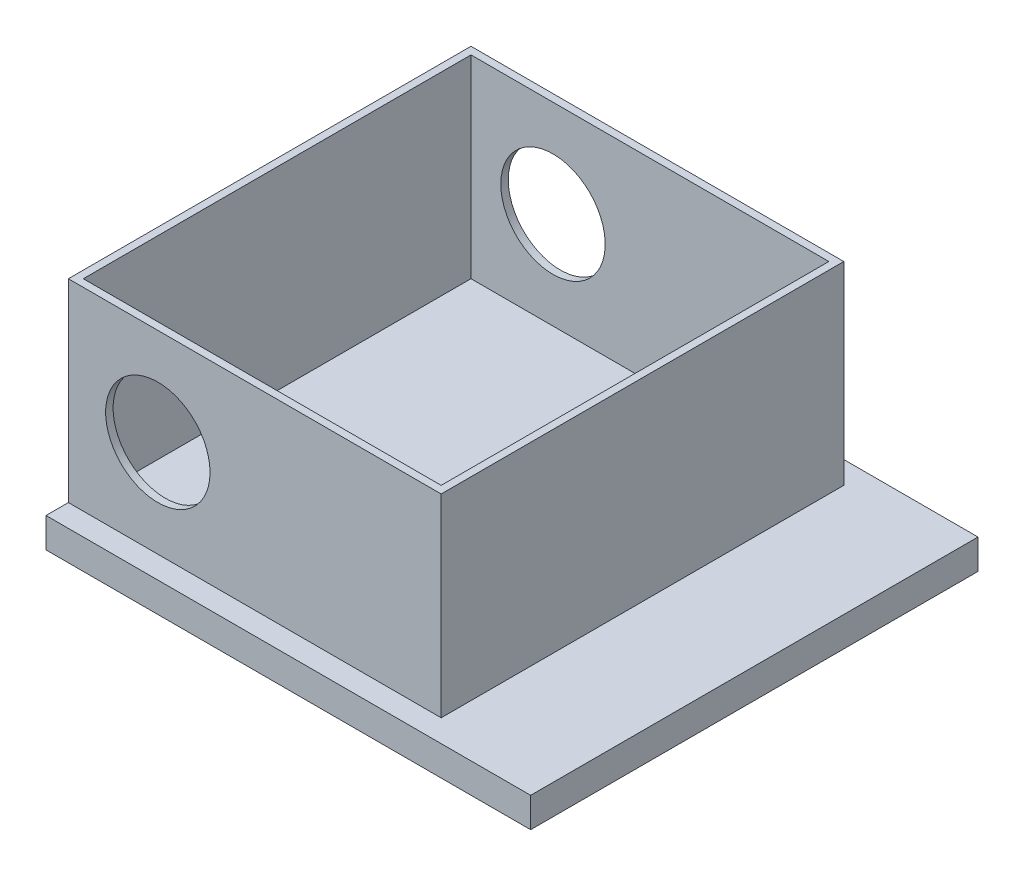
ISO-10303-21;
HEADER;
FILE_DESCRIPTION(('STEP AP214'),'2;1');
FILE_NAME('part.step','',(''),(''),'','','');
FILE_SCHEMA(('AUTOMOTIVE_DESIGN { 1 0 10303 214 1 1 1 1 }'));
ENDSEC;
DATA;
#1=APPLICATION_CONTEXT('core data for automotive mechanical design processes');
#2=APPLICATION_PROTOCOL_DEFINITION('international standard','automotive_design',2000,#1);
#3=PRODUCT_CONTEXT('',#1,'mechanical');
#4=PRODUCT('Part','Part','',(#3));
#5=PRODUCT_RELATED_PRODUCT_CATEGORY('part','',(#4));
#6=PRODUCT_DEFINITION_FORMATION('','',#4);
#7=PRODUCT_DEFINITION_CONTEXT('part definition',#1,'design');
#8=PRODUCT_DEFINITION('design','',#6,#7);
#9=PRODUCT_DEFINITION_SHAPE('','',#8);
#10=(LENGTH_UNIT() NAMED_UNIT(*) SI_UNIT(.MILLI.,.METRE.));
#11=(NAMED_UNIT(*) PLANE_ANGLE_UNIT() SI_UNIT($,.RADIAN.));
#12=(NAMED_UNIT(*) SI_UNIT($,.STERADIAN.) SOLID_ANGLE_UNIT());
#13=UNCERTAINTY_MEASURE_WITH_UNIT(LENGTH_MEASURE(1.E-05),#10,'distance_accuracy_value','');
#14=(GEOMETRIC_REPRESENTATION_CONTEXT(3) GLOBAL_UNCERTAINTY_ASSIGNED_CONTEXT((#13)) GLOBAL_UNIT_ASSIGNED_CONTEXT((#10,
#11,#12)) REPRESENTATION_CONTEXT('',''));
#15=CARTESIAN_POINT('',(0.,0.,0.));
#16=DIRECTION('',(0.,0.,1.));
#17=DIRECTION('',(1.,0.,0.));
#18=AXIS2_PLACEMENT_3D('',#15,#16,#17);
#19=CARTESIAN_POINT('',(0.,2.,0.));
#20=DIRECTION('',(0.,1.,0.));
#21=DIRECTION('',(0.,0.,1.));
#22=AXIS2_PLACEMENT_3D('',#19,#20,#21);
#23=PLANE('',#22);
#24=DIRECTION('',(0.,0.,1.));
#25=VECTOR('',#24,1.);
#26=CARTESIAN_POINT('',(4.57894736842105,2.,0.));
#27=LINE('',#26,#25);
#28=CARTESIAN_POINT('',(4.57894736842105,2.,-23.7894736842105));
#29=VERTEX_POINT('',#28);
#30=CARTESIAN_POINT('',(4.57894736842105,2.,3.21052631578947));
#31=VERTEX_POINT('',#30);
#32=EDGE_CURVE('E213',#29,#31,#27,.T.);
#33=ORIENTED_EDGE('',*,*,#32,.T.);
#34=DIRECTION('',(-1.,0.,0.));
#35=VECTOR('',#34,1.);
#36=CARTESIAN_POINT('',(0.,2.,3.21052631578947));
#37=LINE('',#36,#35);
#38=CARTESIAN_POINT('',(-20.421052631579,2.,3.21052631578947));
#39=VERTEX_POINT('',#38);
#40=EDGE_CURVE('E217',#31,#39,#37,.T.);
#41=ORIENTED_EDGE('',*,*,#40,.T.);
#42=DIRECTION('',(0.,0.,-1.));
#43=VECTOR('',#42,1.);
#44=CARTESIAN_POINT('',(-20.421052631579,2.,0.));
#45=LINE('',#44,#43);
#46=CARTESIAN_POINT('',(-20.421052631579,2.,4.71052631578947));
#47=VERTEX_POINT('',#46);
#48=EDGE_CURVE('E139',#47,#39,#45,.T.);
#49=ORIENTED_EDGE('',*,*,#48,.F.);
#50=DIRECTION('',(-1.,0.,0.));
#51=VECTOR('',#50,1.);
#52=CARTESIAN_POINT('',(0.,2.,4.71052631578947));
#53=LINE('',#52,#51);
#54=CARTESIAN_POINT('',(12.078947368421,2.,4.71052631578946));
#55=VERTEX_POINT('',#54);
#56=EDGE_CURVE('E235',#55,#47,#53,.T.);
#57=ORIENTED_EDGE('',*,*,#56,.F.);
#58=DIRECTION('',(0.,0.,1.));
#59=VECTOR('',#58,1.);
#60=CARTESIAN_POINT('',(12.078947368421,2.,0.));
#61=LINE('',#60,#59);
#62=CARTESIAN_POINT('',(12.078947368421,2.,-25.2894736842105));
#63=VERTEX_POINT('',#62);
#64=EDGE_CURVE('E240',#63,#55,#61,.T.);
#65=ORIENTED_EDGE('',*,*,#64,.F.);
#66=DIRECTION('',(1.,0.,0.));
#67=VECTOR('',#66,1.);
#68=CARTESIAN_POINT('',(0.,2.,-25.2894736842105));
#69=LINE('',#68,#67);
#70=CARTESIAN_POINT('',(-20.421052631579,2.,-25.2894736842105));
#71=VERTEX_POINT('',#70);
#72=EDGE_CURVE('E244',#71,#63,#69,.T.);
#73=ORIENTED_EDGE('',*,*,#72,.F.);
#74=CARTESIAN_POINT('',(-20.421052631579,2.,-23.7894736842105));
#75=VERTEX_POINT('',#74);
#76=EDGE_CURVE('E236',#75,#71,#45,.T.);
#77=ORIENTED_EDGE('',*,*,#76,.F.);
#78=DIRECTION('',(1.,0.,0.));
#79=VECTOR('',#78,1.);
#80=CARTESIAN_POINT('',(0.,2.,-23.7894736842105));
#81=LINE('',#80,#79);
#82=EDGE_CURVE('E209',#75,#29,#81,.T.);
#83=ORIENTED_EDGE('',*,*,#82,.T.);
#84=EDGE_LOOP('',(#33,#41,#49,#57,#65,#73,#77,#83));
#85=FACE_BOUND('',#84,.T.);
#86=ADVANCED_FACE('F41',(#85),#23,.T.);
#87=CARTESIAN_POINT('',(-20.421052631579,2.,0.));
#88=DIRECTION('',(-1.,0.,0.));
#89=DIRECTION('',(0.,0.,1.));
#90=AXIS2_PLACEMENT_3D('',#87,#88,#89);
#91=PLANE('',#90);
#92=DIRECTION('',(0.,-1.,0.));
#93=VECTOR('',#92,1.);
#94=CARTESIAN_POINT('',(-20.421052631579,2.,-25.2894736842105));
#95=LINE('',#94,#93);
#96=CARTESIAN_POINT('',(-20.421052631579,0.,-25.2894736842105));
#97=VERTEX_POINT('',#96);
#98=EDGE_CURVE('E248',#71,#97,#95,.T.);
#99=ORIENTED_EDGE('',*,*,#98,.T.);
#100=DIRECTION('',(0.,0.,-1.));
#101=VECTOR('',#100,1.);
#102=CARTESIAN_POINT('',(-20.421052631579,0.,0.));
#103=LINE('',#102,#101);
#104=CARTESIAN_POINT('',(-20.421052631579,0.,4.71052631578947));
#105=VERTEX_POINT('',#104);
#106=EDGE_CURVE('E232',#105,#97,#103,.T.);
#107=ORIENTED_EDGE('',*,*,#106,.F.);
#108=DIRECTION('',(0.,-1.,0.));
#109=VECTOR('',#108,1.);
#110=CARTESIAN_POINT('',(-20.421052631579,2.,4.71052631578947));
#111=LINE('',#110,#109);
#112=EDGE_CURVE('E11',#47,#105,#111,.T.);
#113=ORIENTED_EDGE('',*,*,#112,.F.);
#114=ORIENTED_EDGE('',*,*,#48,.T.);
#115=DIRECTION('',(0.,-1.,0.));
#116=VECTOR('',#115,1.);
#117=CARTESIAN_POINT('',(-20.421052631579,15.,3.21052631578947));
#118=LINE('',#117,#116);
#119=CARTESIAN_POINT('',(-20.421052631579,15.,3.21052631578947));
#120=VERTEX_POINT('',#119);
#121=EDGE_CURVE('E132',#120,#39,#118,.T.);
#122=ORIENTED_EDGE('',*,*,#121,.F.);
#123=DIRECTION('',(0.,0.,-1.));
#124=VECTOR('',#123,1.);
#125=CARTESIAN_POINT('',(-20.421052631579,15.,0.));
#126=LINE('',#125,#124);
#127=CARTESIAN_POINT('',(-20.421052631579,15.,-23.7894736842105));
#128=VERTEX_POINT('',#127);
#129=EDGE_CURVE('E137',#120,#128,#126,.T.);
#130=ORIENTED_EDGE('',*,*,#129,.T.);
#131=DIRECTION('',(0.,-1.,0.));
#132=VECTOR('',#131,1.);
#133=CARTESIAN_POINT('',(-20.421052631579,15.,-23.7894736842105));
#134=LINE('',#133,#132);
#135=EDGE_CURVE('E185',#128,#75,#134,.T.);
#136=ORIENTED_EDGE('',*,*,#135,.T.);
#137=ORIENTED_EDGE('',*,*,#76,.T.);
#138=EDGE_LOOP('',(#99,#107,#113,#114,#122,#130,#136,#137));
#139=FACE_BOUND('',#138,.T.);
#140=ADVANCED_FACE('F43',(#139),#91,.T.);
#141=CARTESIAN_POINT('',(0.,2.,4.71052631578947));
#142=DIRECTION('',(0.,0.,1.));
#143=DIRECTION('',(1.,0.,0.));
#144=AXIS2_PLACEMENT_3D('',#141,#142,#143);
#145=PLANE('',#144);
#146=DIRECTION('',(-1.,0.,0.));
#147=VECTOR('',#146,1.);
#148=CARTESIAN_POINT('',(0.,0.,4.71052631578947));
#149=LINE('',#148,#147);
#150=CARTESIAN_POINT('',(12.078947368421,0.,4.71052631578946));
#151=VERTEX_POINT('',#150);
#152=EDGE_CURVE('E251',#151,#105,#149,.T.);
#153=ORIENTED_EDGE('',*,*,#152,.F.);
#154=DIRECTION('',(0.,-1.,0.));
#155=VECTOR('',#154,1.);
#156=CARTESIAN_POINT('',(12.078947368421,2.,4.71052631578946));
#157=LINE('',#156,#155);
#158=EDGE_CURVE('E50',#55,#151,#157,.T.);
#159=ORIENTED_EDGE('',*,*,#158,.F.);
#160=ORIENTED_EDGE('',*,*,#56,.T.);
#161=ORIENTED_EDGE('',*,*,#112,.T.);
#162=EDGE_LOOP('',(#153,#159,#160,#161));
#163=FACE_BOUND('',#162,.T.);
#164=ADVANCED_FACE('F275',(#163),#145,.T.);
#165=CARTESIAN_POINT('',(12.078947368421,2.,0.));
#166=DIRECTION('',(1.,0.,0.));
#167=DIRECTION('',(0.,0.,-1.));
#168=AXIS2_PLACEMENT_3D('',#165,#166,#167);
#169=PLANE('',#168);
#170=DIRECTION('',(0.,0.,1.));
#171=VECTOR('',#170,1.);
#172=CARTESIAN_POINT('',(12.078947368421,0.,0.));
#173=LINE('',#172,#171);
#174=CARTESIAN_POINT('',(12.078947368421,0.,-25.2894736842105));
#175=VERTEX_POINT('',#174);
#176=EDGE_CURVE('E255',#175,#151,#173,.T.);
#177=ORIENTED_EDGE('',*,*,#176,.F.);
#178=DIRECTION('',(0.,-1.,0.));
#179=VECTOR('',#178,1.);
#180=CARTESIAN_POINT('',(12.078947368421,2.,-25.2894736842105));
#181=LINE('',#180,#179);
#182=EDGE_CURVE('E265',#63,#175,#181,.T.);
#183=ORIENTED_EDGE('',*,*,#182,.F.);
#184=ORIENTED_EDGE('',*,*,#64,.T.);
#185=ORIENTED_EDGE('',*,*,#158,.T.);
#186=EDGE_LOOP('',(#177,#183,#184,#185));
#187=FACE_BOUND('',#186,.T.);
#188=ADVANCED_FACE('F271',(#187),#169,.T.);
#189=CARTESIAN_POINT('',(0.,2.,-25.2894736842105));
#190=DIRECTION('',(0.,0.,-1.));
#191=DIRECTION('',(-1.,0.,0.));
#192=AXIS2_PLACEMENT_3D('',#189,#190,#191);
#193=PLANE('',#192);
#194=DIRECTION('',(1.,0.,0.));
#195=VECTOR('',#194,1.);
#196=CARTESIAN_POINT('',(0.,0.,-25.2894736842105));
#197=LINE('',#196,#195);
#198=EDGE_CURVE('E259',#97,#175,#197,.T.);
#199=ORIENTED_EDGE('',*,*,#198,.F.);
#200=ORIENTED_EDGE('',*,*,#98,.F.);
#201=ORIENTED_EDGE('',*,*,#72,.T.);
#202=ORIENTED_EDGE('',*,*,#182,.T.);
#203=EDGE_LOOP('',(#199,#200,#201,#202));
#204=FACE_BOUND('',#203,.T.);
#205=ADVANCED_FACE('F282',(#204),#193,.T.);
#206=CARTESIAN_POINT('',(0.,0.,0.));
#207=DIRECTION('',(0.,1.,0.));
#208=DIRECTION('',(0.,0.,1.));
#209=AXIS2_PLACEMENT_3D('',#206,#207,#208);
#210=PLANE('',#209);
#211=ORIENTED_EDGE('',*,*,#106,.T.);
#212=ORIENTED_EDGE('',*,*,#198,.T.);
#213=ORIENTED_EDGE('',*,*,#176,.T.);
#214=ORIENTED_EDGE('',*,*,#152,.T.);
#215=EDGE_LOOP('',(#211,#212,#213,#214));
#216=FACE_BOUND('',#215,.T.);
#217=ADVANCED_FACE('F278',(#216),#210,.F.);
#218=CARTESIAN_POINT('',(0.,15.,2.71052631578947));
#219=DIRECTION('',(0.,0.,1.));
#220=DIRECTION('',(1.,0.,0.));
#221=AXIS2_PLACEMENT_3D('',#218,#219,#220);
#222=PLANE('',#221);
#223=CARTESIAN_POINT('',(-14.421052631579,8.5,2.71052631578947));
#224=DIRECTION('',(0.,0.,1.));
#225=DIRECTION('',(1.,0.,0.));
#226=AXIS2_PLACEMENT_3D('',#223,#224,#225);
#227=CIRCLE('',#226,3.5);
#228=CARTESIAN_POINT('',(-10.921052631579,8.5,2.71052631578947));
#229=VERTEX_POINT('',#228);
#230=EDGE_CURVE('E160',#229,#229,#227,.T.);
#231=ORIENTED_EDGE('',*,*,#230,.T.);
#232=EDGE_LOOP('',(#231));
#233=FACE_BOUND('',#232,.T.);
#234=DIRECTION('',(1.,0.,0.));
#235=VECTOR('',#234,1.);
#236=CARTESIAN_POINT('',(0.,2.,2.71052631578947));
#237=LINE('',#236,#235);
#238=CARTESIAN_POINT('',(-19.921052631579,2.,2.71052631578947));
#239=VERTEX_POINT('',#238);
#240=CARTESIAN_POINT('',(4.07894736842105,2.,2.71052631578946));
#241=VERTEX_POINT('',#240);
#242=EDGE_CURVE('E228',#239,#241,#237,.T.);
#243=ORIENTED_EDGE('',*,*,#242,.F.);
#244=DIRECTION('',(0.,-1.,0.));
#245=VECTOR('',#244,1.);
#246=CARTESIAN_POINT('',(-19.921052631579,15.,2.71052631578947));
#247=LINE('',#246,#245);
#248=CARTESIAN_POINT('',(-19.921052631579,15.,2.71052631578947));
#249=VERTEX_POINT('',#248);
#250=EDGE_CURVE('E195',#249,#239,#247,.T.);
#251=ORIENTED_EDGE('',*,*,#250,.F.);
#252=DIRECTION('',(-1.,0.,0.));
#253=VECTOR('',#252,1.);
#254=CARTESIAN_POINT('',(0.,15.,2.71052631578947));
#255=LINE('',#254,#253);
#256=CARTESIAN_POINT('',(4.07894736842105,15.,2.71052631578946));
#257=VERTEX_POINT('',#256);
#258=EDGE_CURVE('E172',#257,#249,#255,.T.);
#259=ORIENTED_EDGE('',*,*,#258,.F.);
#260=DIRECTION('',(0.,-1.,0.));
#261=VECTOR('',#260,1.);
#262=CARTESIAN_POINT('',(4.07894736842105,15.,2.71052631578946));
#263=LINE('',#262,#261);
#264=EDGE_CURVE('E143',#257,#241,#263,.T.);
#265=ORIENTED_EDGE('',*,*,#264,.T.);
#266=EDGE_LOOP('',(#243,#251,#259,#265));
#267=FACE_BOUND('',#266,.T.);
#268=ADVANCED_FACE('F331',(#233,#267),#222,.F.);
#269=CARTESIAN_POINT('',(-19.921052631579,15.,0.));
#270=DIRECTION('',(-1.,0.,0.));
#271=DIRECTION('',(0.,0.,1.));
#272=AXIS2_PLACEMENT_3D('',#269,#270,#271);
#273=PLANE('',#272);
#274=DIRECTION('',(0.,0.,1.));
#275=VECTOR('',#274,1.);
#276=CARTESIAN_POINT('',(-19.921052631579,2.,0.));
#277=LINE('',#276,#275);
#278=CARTESIAN_POINT('',(-19.921052631579,2.,-23.2894736842105));
#279=VERTEX_POINT('',#278);
#280=EDGE_CURVE('E224',#279,#239,#277,.T.);
#281=ORIENTED_EDGE('',*,*,#280,.F.);
#282=DIRECTION('',(0.,-1.,0.));
#283=VECTOR('',#282,1.);
#284=CARTESIAN_POINT('',(-19.921052631579,15.,-23.2894736842105));
#285=LINE('',#284,#283);
#286=CARTESIAN_POINT('',(-19.921052631579,15.,-23.2894736842105));
#287=VERTEX_POINT('',#286);
#288=EDGE_CURVE('E191',#287,#279,#285,.T.);
#289=ORIENTED_EDGE('',*,*,#288,.F.);
#290=DIRECTION('',(0.,0.,-1.));
#291=VECTOR('',#290,1.);
#292=CARTESIAN_POINT('',(-19.921052631579,15.,0.));
#293=LINE('',#292,#291);
#294=EDGE_CURVE('E176',#249,#287,#293,.T.);
#295=ORIENTED_EDGE('',*,*,#294,.F.);
#296=ORIENTED_EDGE('',*,*,#250,.T.);
#297=EDGE_LOOP('',(#281,#289,#295,#296));
#298=FACE_BOUND('',#297,.T.);
#299=ADVANCED_FACE('F323',(#298),#273,.F.);
#300=CARTESIAN_POINT('',(0.,15.,-23.2894736842105));
#301=DIRECTION('',(0.,0.,-1.));
#302=DIRECTION('',(-1.,0.,0.));
#303=AXIS2_PLACEMENT_3D('',#300,#301,#302);
#304=PLANE('',#303);
#305=CARTESIAN_POINT('',(-14.421052631579,8.5,-23.2894736842105));
#306=DIRECTION('',(0.,0.,-1.));
#307=DIRECTION('',(-1.,0.,0.));
#308=AXIS2_PLACEMENT_3D('',#305,#306,#307);
#309=CIRCLE('',#308,3.5);
#310=CARTESIAN_POINT('',(-17.921052631579,8.5,-23.2894736842105));
#311=VERTEX_POINT('',#310);
#312=EDGE_CURVE('E350',#311,#311,#309,.T.);
#313=ORIENTED_EDGE('',*,*,#312,.T.);
#314=EDGE_LOOP('',(#313));
#315=FACE_BOUND('',#314,.T.);
#316=DIRECTION('',(-1.,0.,0.));
#317=VECTOR('',#316,1.);
#318=CARTESIAN_POINT('',(0.,2.,-23.2894736842105));
#319=LINE('',#318,#317);
#320=CARTESIAN_POINT('',(4.07894736842105,2.,-23.2894736842105));
#321=VERTEX_POINT('',#320);
#322=EDGE_CURVE('E220',#321,#279,#319,.T.);
#323=ORIENTED_EDGE('',*,*,#322,.F.);
#324=DIRECTION('',(0.,-1.,0.));
#325=VECTOR('',#324,1.);
#326=CARTESIAN_POINT('',(4.07894736842105,15.,-23.2894736842105));
#327=LINE('',#326,#325);
#328=CARTESIAN_POINT('',(4.07894736842105,15.,-23.2894736842105));
#329=VERTEX_POINT('',#328);
#330=EDGE_CURVE('E65',#329,#321,#327,.T.);
#331=ORIENTED_EDGE('',*,*,#330,.F.);
#332=DIRECTION('',(1.,0.,0.));
#333=VECTOR('',#332,1.);
#334=CARTESIAN_POINT('',(0.,15.,-23.2894736842105));
#335=LINE('',#334,#333);
#336=EDGE_CURVE('E179',#287,#329,#335,.T.);
#337=ORIENTED_EDGE('',*,*,#336,.F.);
#338=ORIENTED_EDGE('',*,*,#288,.T.);
#339=EDGE_LOOP('',(#323,#331,#337,#338));
#340=FACE_BOUND('',#339,.T.);
#341=ADVANCED_FACE('F327',(#315,#340),#304,.F.);
#342=CARTESIAN_POINT('',(0.,15.,3.21052631578947));
#343=DIRECTION('',(0.,0.,-1.));
#344=DIRECTION('',(-1.,0.,0.));
#345=AXIS2_PLACEMENT_3D('',#342,#343,#344);
#346=PLANE('',#345);
#347=CARTESIAN_POINT('',(-14.421052631579,8.5,3.21052631578947));
#348=DIRECTION('',(0.,0.,1.));
#349=DIRECTION('',(1.,0.,0.));
#350=AXIS2_PLACEMENT_3D('',#347,#348,#349);
#351=CIRCLE('',#350,3.5);
#352=CARTESIAN_POINT('',(-10.921052631579,8.5,3.21052631578947));
#353=VERTEX_POINT('',#352);
#354=EDGE_CURVE('E164',#353,#353,#351,.T.);
#355=ORIENTED_EDGE('',*,*,#354,.F.);
#356=EDGE_LOOP('',(#355));
#357=FACE_BOUND('',#356,.T.);
#358=ORIENTED_EDGE('',*,*,#40,.F.);
#359=DIRECTION('',(0.,-1.,0.));
#360=VECTOR('',#359,1.);
#361=CARTESIAN_POINT('',(4.57894736842105,15.,3.21052631578947));
#362=LINE('',#361,#360);
#363=CARTESIAN_POINT('',(4.57894736842105,15.,3.21052631578947));
#364=VERTEX_POINT('',#363);
#365=EDGE_CURVE('E144',#364,#31,#362,.T.);
#366=ORIENTED_EDGE('',*,*,#365,.F.);
#367=DIRECTION('',(1.,0.,0.));
#368=VECTOR('',#367,1.);
#369=CARTESIAN_POINT('',(0.,15.,3.21052631578947));
#370=LINE('',#369,#368);
#371=EDGE_CURVE('E147',#120,#364,#370,.T.);
#372=ORIENTED_EDGE('',*,*,#371,.F.);
#373=ORIENTED_EDGE('',*,*,#121,.T.);
#374=EDGE_LOOP('',(#358,#366,#372,#373));
#375=FACE_BOUND('',#374,.T.);
#376=ADVANCED_FACE('F148',(#357,#375),#346,.F.);
#377=CARTESIAN_POINT('',(4.57894736842105,15.,0.));
#378=DIRECTION('',(-1.,0.,0.));
#379=DIRECTION('',(0.,0.,1.));
#380=AXIS2_PLACEMENT_3D('',#377,#378,#379);
#381=PLANE('',#380);
#382=ORIENTED_EDGE('',*,*,#32,.F.);
#383=DIRECTION('',(0.,-1.,0.));
#384=VECTOR('',#383,1.);
#385=CARTESIAN_POINT('',(4.57894736842105,15.,-23.7894736842105));
#386=LINE('',#385,#384);
#387=CARTESIAN_POINT('',(4.57894736842105,15.,-23.7894736842105));
#388=VERTEX_POINT('',#387);
#389=EDGE_CURVE('E57',#388,#29,#386,.T.);
#390=ORIENTED_EDGE('',*,*,#389,.F.);
#391=DIRECTION('',(0.,0.,-1.));
#392=VECTOR('',#391,1.);
#393=CARTESIAN_POINT('',(4.57894736842105,15.,0.));
#394=LINE('',#393,#392);
#395=EDGE_CURVE('E153',#364,#388,#394,.T.);
#396=ORIENTED_EDGE('',*,*,#395,.F.);
#397=ORIENTED_EDGE('',*,*,#365,.T.);
#398=EDGE_LOOP('',(#382,#390,#396,#397));
#399=FACE_BOUND('',#398,.T.);
#400=ADVANCED_FACE('F287',(#399),#381,.F.);
#401=CARTESIAN_POINT('',(0.,15.,-23.7894736842105));
#402=DIRECTION('',(0.,0.,1.));
#403=DIRECTION('',(1.,0.,0.));
#404=AXIS2_PLACEMENT_3D('',#401,#402,#403);
#405=PLANE('',#404);
#406=CARTESIAN_POINT('',(-14.421052631579,8.5,-23.7894736842105));
#407=DIRECTION('',(0.,0.,-1.));
#408=DIRECTION('',(-1.,0.,0.));
#409=AXIS2_PLACEMENT_3D('',#406,#407,#408);
#410=CIRCLE('',#409,3.5);
#411=CARTESIAN_POINT('',(-17.921052631579,8.5,-23.7894736842105));
#412=VERTEX_POINT('',#411);
#413=EDGE_CURVE('E352',#412,#412,#410,.T.);
#414=ORIENTED_EDGE('',*,*,#413,.F.);
#415=EDGE_LOOP('',(#414));
#416=FACE_BOUND('',#415,.T.);
#417=ORIENTED_EDGE('',*,*,#82,.F.);
#418=ORIENTED_EDGE('',*,*,#135,.F.);
#419=DIRECTION('',(-1.,0.,0.));
#420=VECTOR('',#419,1.);
#421=CARTESIAN_POINT('',(0.,15.,-23.7894736842105));
#422=LINE('',#421,#420);
#423=EDGE_CURVE('E157',#388,#128,#422,.T.);
#424=ORIENTED_EDGE('',*,*,#423,.F.);
#425=ORIENTED_EDGE('',*,*,#389,.T.);
#426=EDGE_LOOP('',(#417,#418,#424,#425));
#427=FACE_BOUND('',#426,.T.);
#428=ADVANCED_FACE('F288',(#416,#427),#405,.F.);
#429=CARTESIAN_POINT('',(4.07894736842105,15.,0.));
#430=DIRECTION('',(1.,0.,0.));
#431=DIRECTION('',(0.,0.,-1.));
#432=AXIS2_PLACEMENT_3D('',#429,#430,#431);
#433=PLANE('',#432);
#434=DIRECTION('',(0.,0.,-1.));
#435=VECTOR('',#434,1.);
#436=CARTESIAN_POINT('',(4.07894736842105,2.,0.));
#437=LINE('',#436,#435);
#438=EDGE_CURVE('E199',#241,#321,#437,.T.);
#439=ORIENTED_EDGE('',*,*,#438,.F.);
#440=ORIENTED_EDGE('',*,*,#264,.F.);
#441=DIRECTION('',(0.,0.,1.));
#442=VECTOR('',#441,1.);
#443=CARTESIAN_POINT('',(4.07894736842105,15.,0.));
#444=LINE('',#443,#442);
#445=EDGE_CURVE('E182',#329,#257,#444,.T.);
#446=ORIENTED_EDGE('',*,*,#445,.F.);
#447=ORIENTED_EDGE('',*,*,#330,.T.);
#448=EDGE_LOOP('',(#439,#440,#446,#447));
#449=FACE_BOUND('',#448,.T.);
#450=ADVANCED_FACE('F291',(#449),#433,.F.);
#451=CARTESIAN_POINT('',(0.,15.,0.));
#452=DIRECTION('',(0.,1.,0.));
#453=DIRECTION('',(0.,0.,1.));
#454=AXIS2_PLACEMENT_3D('',#451,#452,#453);
#455=PLANE('',#454);
#456=ORIENTED_EDGE('',*,*,#129,.F.);
#457=ORIENTED_EDGE('',*,*,#371,.T.);
#458=ORIENTED_EDGE('',*,*,#395,.T.);
#459=ORIENTED_EDGE('',*,*,#423,.T.);
#460=EDGE_LOOP('',(#456,#457,#458,#459));
#461=FACE_BOUND('',#460,.T.);
#462=ORIENTED_EDGE('',*,*,#258,.T.);
#463=ORIENTED_EDGE('',*,*,#294,.T.);
#464=ORIENTED_EDGE('',*,*,#336,.T.);
#465=ORIENTED_EDGE('',*,*,#445,.T.);
#466=EDGE_LOOP('',(#462,#463,#464,#465));
#467=FACE_BOUND('',#466,.T.);
#468=ADVANCED_FACE('F155',(#461,#467),#455,.T.);
#469=ORIENTED_EDGE('',*,*,#280,.T.);
#470=ORIENTED_EDGE('',*,*,#242,.T.);
#471=ORIENTED_EDGE('',*,*,#438,.T.);
#472=ORIENTED_EDGE('',*,*,#322,.T.);
#473=EDGE_LOOP('',(#469,#470,#471,#472));
#474=FACE_BOUND('',#473,.T.);
#475=ADVANCED_FACE('F304',(#474),#23,.T.);
#476=CARTESIAN_POINT('',(-14.421052631579,8.5,2.71052631578947));
#477=DIRECTION('',(0.,0.,1.));
#478=DIRECTION('',(1.,0.,0.));
#479=AXIS2_PLACEMENT_3D('',#476,#477,#478);
#480=CYLINDRICAL_SURFACE('',#479,3.5);
#481=ORIENTED_EDGE('',*,*,#230,.F.);
#482=EDGE_LOOP('',(#481));
#483=FACE_BOUND('',#482,.T.);
#484=ORIENTED_EDGE('',*,*,#354,.T.);
#485=EDGE_LOOP('',(#484));
#486=FACE_BOUND('',#485,.T.);
#487=ADVANCED_FACE('F311',(#483,#486),#480,.F.);
#488=CARTESIAN_POINT('',(-14.421052631579,8.5,-23.2894736842105));
#489=DIRECTION('',(0.,0.,-1.));
#490=DIRECTION('',(-1.,0.,0.));
#491=AXIS2_PLACEMENT_3D('',#488,#489,#490);
#492=CYLINDRICAL_SURFACE('',#491,3.5);
#493=ORIENTED_EDGE('',*,*,#312,.F.);
#494=EDGE_LOOP('',(#493));
#495=FACE_BOUND('',#494,.T.);
#496=ORIENTED_EDGE('',*,*,#413,.T.);
#497=EDGE_LOOP('',(#496));
#498=FACE_BOUND('',#497,.T.);
#499=ADVANCED_FACE('F317',(#495,#498),#492,.F.);
#500=CLOSED_SHELL('',(#86,#140,#164,#188,#205,#217,#268,#299,#341,#376,#400,#428,#450,#468,#475,
#487,#499));
#501=MANIFOLD_SOLID_BREP('B2',#500);
#502=ADVANCED_BREP_SHAPE_REPRESENTATION('',(#18,#501),#14);
#503=SHAPE_DEFINITION_REPRESENTATION(#9,#502);
ENDSEC;
END-ISO-10303-21;
